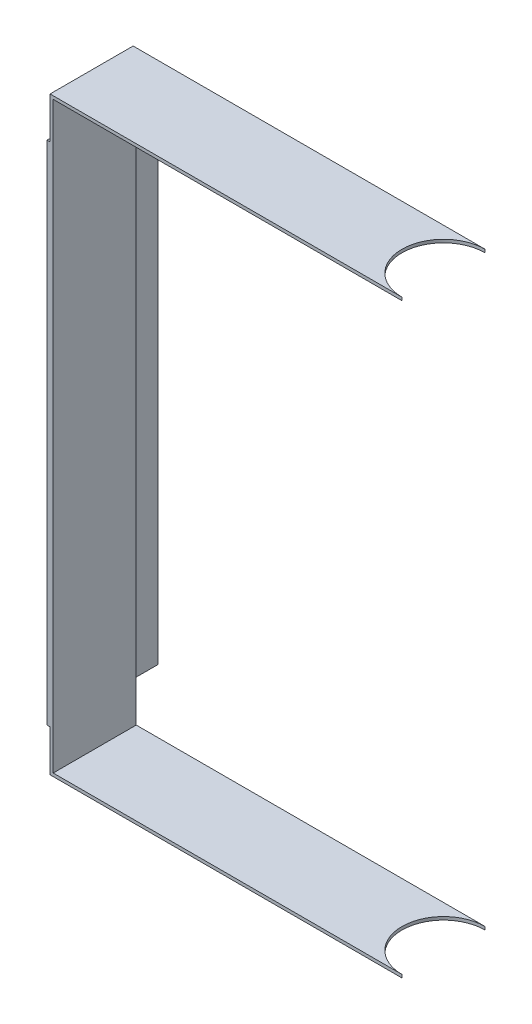
ISO-10303-21;
HEADER;
FILE_DESCRIPTION(('STEP AP214'),'2;1');
FILE_NAME('part.step','',(''),(''),'','','');
FILE_SCHEMA(('AUTOMOTIVE_DESIGN { 1 0 10303 214 1 1 1 1 }'));
ENDSEC;
DATA;
#1=APPLICATION_CONTEXT('core data for automotive mechanical design processes');
#2=APPLICATION_PROTOCOL_DEFINITION('international standard','automotive_design',2000,#1);
#3=PRODUCT_CONTEXT('',#1,'mechanical');
#4=PRODUCT('Part','Part','',(#3));
#5=PRODUCT_RELATED_PRODUCT_CATEGORY('part','',(#4));
#6=PRODUCT_DEFINITION_FORMATION('','',#4);
#7=PRODUCT_DEFINITION_CONTEXT('part definition',#1,'design');
#8=PRODUCT_DEFINITION('design','',#6,#7);
#9=PRODUCT_DEFINITION_SHAPE('','',#8);
#10=(LENGTH_UNIT() NAMED_UNIT(*) SI_UNIT(.MILLI.,.METRE.));
#11=(NAMED_UNIT(*) PLANE_ANGLE_UNIT() SI_UNIT($,.RADIAN.));
#12=(NAMED_UNIT(*) SI_UNIT($,.STERADIAN.) SOLID_ANGLE_UNIT());
#13=UNCERTAINTY_MEASURE_WITH_UNIT(LENGTH_MEASURE(1.E-05),#10,'distance_accuracy_value','');
#14=(GEOMETRIC_REPRESENTATION_CONTEXT(3) GLOBAL_UNCERTAINTY_ASSIGNED_CONTEXT((#13)) GLOBAL_UNIT_ASSIGNED_CONTEXT((#10,
#11,#12)) REPRESENTATION_CONTEXT('',''));
#15=CARTESIAN_POINT('',(0.,0.,0.));
#16=DIRECTION('',(0.,0.,1.));
#17=DIRECTION('',(1.,0.,0.));
#18=AXIS2_PLACEMENT_3D('',#15,#16,#17);
#19=CARTESIAN_POINT('',(-169.5,15.7412558306423,40.));
#20=DIRECTION('',(1.,0.,0.));
#21=DIRECTION('',(0.,0.,-1.));
#22=AXIS2_PLACEMENT_3D('',#19,#20,#21);
#23=PLANE('',#22);
#24=DIRECTION('',(0.,0.,1.));
#25=VECTOR('',#24,1.);
#26=CARTESIAN_POINT('',(-169.5,-248.258744169358,-12.));
#27=LINE('',#26,#25);
#28=CARTESIAN_POINT('',(-169.5,-248.258744169358,0.));
#29=VERTEX_POINT('',#28);
#30=CARTESIAN_POINT('',(-169.5,-248.258744169358,40.));
#31=VERTEX_POINT('',#30);
#32=EDGE_CURVE('E11',#29,#31,#27,.T.);
#33=ORIENTED_EDGE('',*,*,#32,.F.);
#34=DIRECTION('',(0.,-1.,0.));
#35=VECTOR('',#34,1.);
#36=CARTESIAN_POINT('',(-169.5,15.7412558306423,0.));
#37=LINE('',#36,#35);
#38=CARTESIAN_POINT('',(-169.5,-268.258744169358,0.));
#39=VERTEX_POINT('',#38);
#40=EDGE_CURVE('E198',#29,#39,#37,.T.);
#41=ORIENTED_EDGE('',*,*,#40,.T.);
#42=DIRECTION('',(0.,0.,-1.));
#43=VECTOR('',#42,1.);
#44=CARTESIAN_POINT('',(-169.5,-268.258744169358,40.));
#45=LINE('',#44,#43);
#46=CARTESIAN_POINT('',(-169.5,-268.258744169358,40.));
#47=VERTEX_POINT('',#46);
#48=EDGE_CURVE('E217',#47,#39,#45,.T.);
#49=ORIENTED_EDGE('',*,*,#48,.F.);
#50=DIRECTION('',(0.,-1.,0.));
#51=VECTOR('',#50,1.);
#52=CARTESIAN_POINT('',(-169.5,15.7412558306423,40.));
#53=LINE('',#52,#51);
#54=EDGE_CURVE('E55',#31,#47,#53,.T.);
#55=ORIENTED_EDGE('',*,*,#54,.F.);
#56=EDGE_LOOP('',(#33,#41,#49,#55));
#57=FACE_BOUND('',#56,.T.);
#58=ADVANCED_FACE('F38',(#57),#23,.F.);
#59=DIRECTION('',(0.,0.,-1.));
#60=VECTOR('',#59,1.);
#61=CARTESIAN_POINT('',(-169.5,-4.25874416935773,40.));
#62=LINE('',#61,#60);
#63=CARTESIAN_POINT('',(-169.5,-4.25874416935773,40.));
#64=VERTEX_POINT('',#63);
#65=CARTESIAN_POINT('',(-169.5,-4.25874416935773,0.));
#66=VERTEX_POINT('',#65);
#67=EDGE_CURVE('E62',#64,#66,#62,.T.);
#68=ORIENTED_EDGE('',*,*,#67,.F.);
#69=CARTESIAN_POINT('',(-169.5,15.7412558306423,40.));
#70=VERTEX_POINT('',#69);
#71=EDGE_CURVE('E157',#70,#64,#53,.T.);
#72=ORIENTED_EDGE('',*,*,#71,.F.);
#73=DIRECTION('',(0.,0.,-1.));
#74=VECTOR('',#73,1.);
#75=CARTESIAN_POINT('',(-169.5,15.7412558306423,40.));
#76=LINE('',#75,#74);
#77=CARTESIAN_POINT('',(-169.5,15.7412558306423,0.));
#78=VERTEX_POINT('',#77);
#79=EDGE_CURVE('E42',#70,#78,#76,.T.);
#80=ORIENTED_EDGE('',*,*,#79,.T.);
#81=EDGE_CURVE('E199',#78,#66,#37,.T.);
#82=ORIENTED_EDGE('',*,*,#81,.T.);
#83=EDGE_LOOP('',(#68,#72,#80,#82));
#84=FACE_BOUND('',#83,.T.);
#85=ADVANCED_FACE('F225',(#84),#23,.F.);
#86=CARTESIAN_POINT('',(0.,15.7412558306423,40.));
#87=DIRECTION('',(0.,-1.,0.));
#88=DIRECTION('',(0.,0.,-1.));
#89=AXIS2_PLACEMENT_3D('',#86,#87,#88);
#90=PLANE('',#89);
#91=DIRECTION('',(-1.,0.,0.));
#92=VECTOR('',#91,1.);
#93=CARTESIAN_POINT('',(0.,15.7412558306423,40.));
#94=LINE('',#93,#92);
#95=CARTESIAN_POINT('',(0.,15.7412558306423,40.));
#96=VERTEX_POINT('',#95);
#97=EDGE_CURVE('E177',#96,#70,#94,.T.);
#98=ORIENTED_EDGE('',*,*,#97,.F.);
#99=CARTESIAN_POINT('',(0.,15.7412558306423,20.));
#100=DIRECTION('',(0.,-1.,0.));
#101=DIRECTION('',(0.,0.,-1.));
#102=AXIS2_PLACEMENT_3D('',#99,#100,#101);
#103=CIRCLE('',#102,20.);
#104=CARTESIAN_POINT('',(0.,15.7412558306423,0.));
#105=VERTEX_POINT('',#104);
#106=EDGE_CURVE('E171',#96,#105,#103,.T.);
#107=ORIENTED_EDGE('',*,*,#106,.T.);
#108=DIRECTION('',(-1.,0.,0.));
#109=VECTOR('',#108,1.);
#110=CARTESIAN_POINT('',(0.,15.7412558306423,0.));
#111=LINE('',#110,#109);
#112=EDGE_CURVE('E196',#105,#78,#111,.T.);
#113=ORIENTED_EDGE('',*,*,#112,.T.);
#114=ORIENTED_EDGE('',*,*,#79,.F.);
#115=EDGE_LOOP('',(#98,#107,#113,#114));
#116=FACE_BOUND('',#115,.T.);
#117=ADVANCED_FACE('F40',(#116),#90,.F.);
#118=CARTESIAN_POINT('',(-169.5,-268.258744169358,40.));
#119=DIRECTION('',(0.,1.,0.));
#120=DIRECTION('',(0.,0.,1.));
#121=AXIS2_PLACEMENT_3D('',#118,#119,#120);
#122=PLANE('',#121);
#123=DIRECTION('',(1.,0.,0.));
#124=VECTOR('',#123,1.);
#125=CARTESIAN_POINT('',(-169.5,-268.258744169358,0.));
#126=LINE('',#125,#124);
#127=CARTESIAN_POINT('',(0.,-268.258744169358,0.));
#128=VERTEX_POINT('',#127);
#129=EDGE_CURVE('E201',#39,#128,#126,.T.);
#130=ORIENTED_EDGE('',*,*,#129,.T.);
#131=CARTESIAN_POINT('',(0.,-268.258744169358,20.));
#132=DIRECTION('',(0.,-1.,0.));
#133=DIRECTION('',(0.,0.,-1.));
#134=AXIS2_PLACEMENT_3D('',#131,#132,#133);
#135=CIRCLE('',#134,20.);
#136=CARTESIAN_POINT('',(0.,-268.258744169358,40.));
#137=VERTEX_POINT('',#136);
#138=EDGE_CURVE('E158',#137,#128,#135,.T.);
#139=ORIENTED_EDGE('',*,*,#138,.F.);
#140=DIRECTION('',(1.,0.,0.));
#141=VECTOR('',#140,1.);
#142=CARTESIAN_POINT('',(-169.5,-268.258744169358,40.));
#143=LINE('',#142,#141);
#144=EDGE_CURVE('E181',#47,#137,#143,.T.);
#145=ORIENTED_EDGE('',*,*,#144,.F.);
#146=ORIENTED_EDGE('',*,*,#48,.T.);
#147=EDGE_LOOP('',(#130,#139,#145,#146));
#148=FACE_BOUND('',#147,.T.);
#149=ADVANCED_FACE('F268',(#148),#122,.F.);
#150=CARTESIAN_POINT('',(0.,-266.758744169358,40.));
#151=DIRECTION('',(0.,-1.,0.));
#152=DIRECTION('',(0.,0.,-1.));
#153=AXIS2_PLACEMENT_3D('',#150,#151,#152);
#154=PLANE('',#153);
#155=DIRECTION('',(-1.,0.,0.));
#156=VECTOR('',#155,1.);
#157=CARTESIAN_POINT('',(0.,-266.758744169358,40.));
#158=LINE('',#157,#156);
#159=CARTESIAN_POINT('',(0.,-266.758744169358,40.));
#160=VERTEX_POINT('',#159);
#161=CARTESIAN_POINT('',(-168.,-266.758744169358,40.));
#162=VERTEX_POINT('',#161);
#163=EDGE_CURVE('E187',#160,#162,#158,.T.);
#164=ORIENTED_EDGE('',*,*,#163,.F.);
#165=CARTESIAN_POINT('',(0.,-266.758744169358,20.));
#166=DIRECTION('',(0.,-1.,0.));
#167=DIRECTION('',(0.,0.,-1.));
#168=AXIS2_PLACEMENT_3D('',#165,#166,#167);
#169=CIRCLE('',#168,20.);
#170=CARTESIAN_POINT('',(0.,-266.758744169358,0.));
#171=VERTEX_POINT('',#170);
#172=EDGE_CURVE('E160',#160,#171,#169,.T.);
#173=ORIENTED_EDGE('',*,*,#172,.T.);
#174=DIRECTION('',(-1.,0.,0.));
#175=VECTOR('',#174,1.);
#176=CARTESIAN_POINT('',(0.,-266.758744169358,0.));
#177=LINE('',#176,#175);
#178=CARTESIAN_POINT('',(-168.,-266.758744169358,0.));
#179=VERTEX_POINT('',#178);
#180=EDGE_CURVE('E207',#171,#179,#177,.T.);
#181=ORIENTED_EDGE('',*,*,#180,.T.);
#182=DIRECTION('',(0.,0.,-1.));
#183=VECTOR('',#182,1.);
#184=CARTESIAN_POINT('',(-168.,-266.758744169358,40.));
#185=LINE('',#184,#183);
#186=EDGE_CURVE('E215',#162,#179,#185,.T.);
#187=ORIENTED_EDGE('',*,*,#186,.F.);
#188=EDGE_LOOP('',(#164,#173,#181,#187));
#189=FACE_BOUND('',#188,.T.);
#190=ADVANCED_FACE('F271',(#189),#154,.F.);
#191=CARTESIAN_POINT('',(-168.,14.2412558306423,40.));
#192=DIRECTION('',(-1.,0.,0.));
#193=DIRECTION('',(0.,0.,1.));
#194=AXIS2_PLACEMENT_3D('',#191,#192,#193);
#195=PLANE('',#194);
#196=DIRECTION('',(0.,1.,0.));
#197=VECTOR('',#196,1.);
#198=CARTESIAN_POINT('',(-168.,14.2412558306423,0.));
#199=LINE('',#198,#197);
#200=CARTESIAN_POINT('',(-168.,14.2412558306423,0.));
#201=VERTEX_POINT('',#200);
#202=EDGE_CURVE('E209',#179,#201,#199,.T.);
#203=ORIENTED_EDGE('',*,*,#202,.T.);
#204=DIRECTION('',(0.,0.,-1.));
#205=VECTOR('',#204,1.);
#206=CARTESIAN_POINT('',(-168.,14.2412558306423,40.));
#207=LINE('',#206,#205);
#208=CARTESIAN_POINT('',(-168.,14.2412558306423,40.));
#209=VERTEX_POINT('',#208);
#210=EDGE_CURVE('E194',#209,#201,#207,.T.);
#211=ORIENTED_EDGE('',*,*,#210,.F.);
#212=DIRECTION('',(0.,1.,0.));
#213=VECTOR('',#212,1.);
#214=CARTESIAN_POINT('',(-168.,14.2412558306423,40.));
#215=LINE('',#214,#213);
#216=EDGE_CURVE('E189',#162,#209,#215,.T.);
#217=ORIENTED_EDGE('',*,*,#216,.F.);
#218=ORIENTED_EDGE('',*,*,#186,.T.);
#219=EDGE_LOOP('',(#203,#211,#217,#218));
#220=FACE_BOUND('',#219,.T.);
#221=ADVANCED_FACE('F274',(#220),#195,.F.);
#222=CARTESIAN_POINT('',(0.,14.2412558306423,40.));
#223=DIRECTION('',(0.,1.,0.));
#224=DIRECTION('',(0.,0.,1.));
#225=AXIS2_PLACEMENT_3D('',#222,#223,#224);
#226=PLANE('',#225);
#227=DIRECTION('',(1.,0.,0.));
#228=VECTOR('',#227,1.);
#229=CARTESIAN_POINT('',(0.,14.2412558306423,0.));
#230=LINE('',#229,#228);
#231=CARTESIAN_POINT('',(0.,14.2412558306423,0.));
#232=VERTEX_POINT('',#231);
#233=EDGE_CURVE('E178',#201,#232,#230,.T.);
#234=ORIENTED_EDGE('',*,*,#233,.T.);
#235=CARTESIAN_POINT('',(0.,14.2412558306423,20.));
#236=DIRECTION('',(0.,1.,0.));
#237=DIRECTION('',(0.,0.,1.));
#238=AXIS2_PLACEMENT_3D('',#235,#236,#237);
#239=CIRCLE('',#238,20.);
#240=CARTESIAN_POINT('',(0.,14.2412558306423,40.));
#241=VERTEX_POINT('',#240);
#242=EDGE_CURVE('E168',#232,#241,#239,.T.);
#243=ORIENTED_EDGE('',*,*,#242,.T.);
#244=DIRECTION('',(1.,0.,0.));
#245=VECTOR('',#244,1.);
#246=CARTESIAN_POINT('',(0.,14.2412558306423,40.));
#247=LINE('',#246,#245);
#248=EDGE_CURVE('E191',#209,#241,#247,.T.);
#249=ORIENTED_EDGE('',*,*,#248,.F.);
#250=ORIENTED_EDGE('',*,*,#210,.T.);
#251=EDGE_LOOP('',(#234,#243,#249,#250));
#252=FACE_BOUND('',#251,.T.);
#253=ADVANCED_FACE('F278',(#252),#226,.F.);
#254=CARTESIAN_POINT('',(0.,0.,40.));
#255=DIRECTION('',(0.,0.,-1.));
#256=DIRECTION('',(-1.,0.,0.));
#257=AXIS2_PLACEMENT_3D('',#254,#255,#256);
#258=PLANE('',#257);
#259=DIRECTION('',(0.,1.,0.));
#260=VECTOR('',#259,1.);
#261=CARTESIAN_POINT('',(0.,15.7412558306423,40.));
#262=LINE('',#261,#260);
#263=EDGE_CURVE('E175',#241,#96,#262,.T.);
#264=ORIENTED_EDGE('',*,*,#263,.T.);
#265=ORIENTED_EDGE('',*,*,#97,.T.);
#266=ORIENTED_EDGE('',*,*,#71,.T.);
#267=DIRECTION('',(1.,0.,0.));
#268=VECTOR('',#267,1.);
#269=CARTESIAN_POINT('',(-171.,-4.25874416935773,40.));
#270=LINE('',#269,#268);
#271=CARTESIAN_POINT('',(-171.,-4.25874416935773,40.));
#272=VERTEX_POINT('',#271);
#273=EDGE_CURVE('E139',#272,#64,#270,.T.);
#274=ORIENTED_EDGE('',*,*,#273,.F.);
#275=DIRECTION('',(0.,1.,0.));
#276=VECTOR('',#275,1.);
#277=CARTESIAN_POINT('',(-171.,-248.258744169358,40.));
#278=LINE('',#277,#276);
#279=CARTESIAN_POINT('',(-171.,-248.258744169358,40.));
#280=VERTEX_POINT('',#279);
#281=EDGE_CURVE('E145',#280,#272,#278,.T.);
#282=ORIENTED_EDGE('',*,*,#281,.F.);
#283=DIRECTION('',(1.,0.,0.));
#284=VECTOR('',#283,1.);
#285=CARTESIAN_POINT('',(-171.,-248.258744169358,40.));
#286=LINE('',#285,#284);
#287=EDGE_CURVE('E248',#280,#31,#286,.T.);
#288=ORIENTED_EDGE('',*,*,#287,.T.);
#289=ORIENTED_EDGE('',*,*,#54,.T.);
#290=ORIENTED_EDGE('',*,*,#144,.T.);
#291=DIRECTION('',(0.,1.,0.));
#292=VECTOR('',#291,1.);
#293=CARTESIAN_POINT('',(0.,-268.258744169358,40.));
#294=LINE('',#293,#292);
#295=EDGE_CURVE('E184',#137,#160,#294,.T.);
#296=ORIENTED_EDGE('',*,*,#295,.T.);
#297=ORIENTED_EDGE('',*,*,#163,.T.);
#298=ORIENTED_EDGE('',*,*,#216,.T.);
#299=ORIENTED_EDGE('',*,*,#248,.T.);
#300=EDGE_LOOP('',(#264,#265,#266,#274,#282,#288,#289,#290,#296,#297,#298,#299));
#301=FACE_BOUND('',#300,.T.);
#302=ADVANCED_FACE('F156',(#301),#258,.F.);
#303=CARTESIAN_POINT('',(0.,0.,0.));
#304=DIRECTION('',(0.,0.,-1.));
#305=DIRECTION('',(-1.,0.,0.));
#306=AXIS2_PLACEMENT_3D('',#303,#304,#305);
#307=PLANE('',#306);
#308=DIRECTION('',(0.,1.,0.));
#309=VECTOR('',#308,1.);
#310=CARTESIAN_POINT('',(0.,15.7412558306423,0.));
#311=LINE('',#310,#309);
#312=EDGE_CURVE('E174',#232,#105,#311,.T.);
#313=ORIENTED_EDGE('',*,*,#312,.F.);
#314=ORIENTED_EDGE('',*,*,#233,.F.);
#315=ORIENTED_EDGE('',*,*,#202,.F.);
#316=ORIENTED_EDGE('',*,*,#180,.F.);
#317=DIRECTION('',(0.,1.,0.));
#318=VECTOR('',#317,1.);
#319=CARTESIAN_POINT('',(0.,-268.258744169358,0.));
#320=LINE('',#319,#318);
#321=EDGE_CURVE('E205',#128,#171,#320,.T.);
#322=ORIENTED_EDGE('',*,*,#321,.F.);
#323=ORIENTED_EDGE('',*,*,#129,.F.);
#324=ORIENTED_EDGE('',*,*,#40,.F.);
#325=EDGE_CURVE('E202',#66,#29,#37,.T.);
#326=ORIENTED_EDGE('',*,*,#325,.F.);
#327=ORIENTED_EDGE('',*,*,#81,.F.);
#328=ORIENTED_EDGE('',*,*,#112,.F.);
#329=EDGE_LOOP('',(#313,#314,#315,#316,#322,#323,#324,#326,#327,#328));
#330=FACE_BOUND('',#329,.T.);
#331=ADVANCED_FACE('F232',(#330),#307,.T.);
#332=CARTESIAN_POINT('',(0.,67.7412558306423,20.));
#333=DIRECTION('',(0.,-1.,0.));
#334=DIRECTION('',(0.,0.,-1.));
#335=AXIS2_PLACEMENT_3D('',#332,#333,#334);
#336=CYLINDRICAL_SURFACE('',#335,20.);
#337=ORIENTED_EDGE('',*,*,#138,.T.);
#338=ORIENTED_EDGE('',*,*,#321,.T.);
#339=ORIENTED_EDGE('',*,*,#172,.F.);
#340=ORIENTED_EDGE('',*,*,#295,.F.);
#341=EDGE_LOOP('',(#337,#338,#339,#340));
#342=FACE_BOUND('',#341,.T.);
#343=ADVANCED_FACE('F285',(#342),#336,.F.);
#344=ORIENTED_EDGE('',*,*,#242,.F.);
#345=ORIENTED_EDGE('',*,*,#312,.T.);
#346=ORIENTED_EDGE('',*,*,#106,.F.);
#347=ORIENTED_EDGE('',*,*,#263,.F.);
#348=EDGE_LOOP('',(#344,#345,#346,#347));
#349=FACE_BOUND('',#348,.T.);
#350=ADVANCED_FACE('F288',(#349),#336,.F.);
#351=CARTESIAN_POINT('',(-169.5,0.,0.));
#352=DIRECTION('',(-1.,0.,0.));
#353=DIRECTION('',(0.,0.,1.));
#354=AXIS2_PLACEMENT_3D('',#351,#352,#353);
#355=PLANE('',#354);
#356=CARTESIAN_POINT('',(-169.5,-4.25874416935773,-12.));
#357=VERTEX_POINT('',#356);
#358=EDGE_CURVE('E240',#66,#357,#62,.T.);
#359=ORIENTED_EDGE('',*,*,#358,.F.);
#360=ORIENTED_EDGE('',*,*,#325,.T.);
#361=CARTESIAN_POINT('',(-169.5,-248.258744169358,-12.));
#362=VERTEX_POINT('',#361);
#363=EDGE_CURVE('E48',#362,#29,#27,.T.);
#364=ORIENTED_EDGE('',*,*,#363,.F.);
#365=DIRECTION('',(0.,-1.,0.));
#366=VECTOR('',#365,1.);
#367=CARTESIAN_POINT('',(-169.5,-4.25874416935773,-12.));
#368=LINE('',#367,#366);
#369=EDGE_CURVE('E242',#357,#362,#368,.T.);
#370=ORIENTED_EDGE('',*,*,#369,.F.);
#371=EDGE_LOOP('',(#359,#360,#364,#370));
#372=FACE_BOUND('',#371,.T.);
#373=ADVANCED_FACE('F241',(#372),#355,.F.);
#374=CARTESIAN_POINT('',(-171.,-4.25874416935773,40.));
#375=DIRECTION('',(0.,-1.,0.));
#376=DIRECTION('',(0.,0.,-1.));
#377=AXIS2_PLACEMENT_3D('',#374,#375,#376);
#378=PLANE('',#377);
#379=ORIENTED_EDGE('',*,*,#67,.T.);
#380=ORIENTED_EDGE('',*,*,#358,.T.);
#381=DIRECTION('',(1.,0.,0.));
#382=VECTOR('',#381,1.);
#383=CARTESIAN_POINT('',(-171.,-4.25874416935773,-12.));
#384=LINE('',#383,#382);
#385=CARTESIAN_POINT('',(-171.,-4.25874416935773,-12.));
#386=VERTEX_POINT('',#385);
#387=EDGE_CURVE('E141',#386,#357,#384,.T.);
#388=ORIENTED_EDGE('',*,*,#387,.F.);
#389=DIRECTION('',(0.,0.,-1.));
#390=VECTOR('',#389,1.);
#391=CARTESIAN_POINT('',(-171.,-4.25874416935773,40.));
#392=LINE('',#391,#390);
#393=EDGE_CURVE('E135',#272,#386,#392,.T.);
#394=ORIENTED_EDGE('',*,*,#393,.F.);
#395=ORIENTED_EDGE('',*,*,#273,.T.);
#396=EDGE_LOOP('',(#379,#380,#388,#394,#395));
#397=FACE_BOUND('',#396,.T.);
#398=ADVANCED_FACE('F137',(#397),#378,.F.);
#399=CARTESIAN_POINT('',(-171.,-4.25874416935773,-12.));
#400=DIRECTION('',(0.,0.,1.));
#401=DIRECTION('',(1.,0.,0.));
#402=AXIS2_PLACEMENT_3D('',#399,#400,#401);
#403=PLANE('',#402);
#404=ORIENTED_EDGE('',*,*,#369,.T.);
#405=DIRECTION('',(1.,0.,0.));
#406=VECTOR('',#405,1.);
#407=CARTESIAN_POINT('',(-171.,-248.258744169358,-12.));
#408=LINE('',#407,#406);
#409=CARTESIAN_POINT('',(-171.,-248.258744169358,-12.));
#410=VERTEX_POINT('',#409);
#411=EDGE_CURVE('E162',#410,#362,#408,.T.);
#412=ORIENTED_EDGE('',*,*,#411,.F.);
#413=DIRECTION('',(0.,-1.,0.));
#414=VECTOR('',#413,1.);
#415=CARTESIAN_POINT('',(-171.,-4.25874416935773,-12.));
#416=LINE('',#415,#414);
#417=EDGE_CURVE('E144',#386,#410,#416,.T.);
#418=ORIENTED_EDGE('',*,*,#417,.F.);
#419=ORIENTED_EDGE('',*,*,#387,.T.);
#420=EDGE_LOOP('',(#404,#412,#418,#419));
#421=FACE_BOUND('',#420,.T.);
#422=ADVANCED_FACE('F254',(#421),#403,.F.);
#423=CARTESIAN_POINT('',(-171.,-248.258744169358,-12.));
#424=DIRECTION('',(0.,1.,0.));
#425=DIRECTION('',(0.,0.,1.));
#426=AXIS2_PLACEMENT_3D('',#423,#424,#425);
#427=PLANE('',#426);
#428=ORIENTED_EDGE('',*,*,#363,.T.);
#429=ORIENTED_EDGE('',*,*,#32,.T.);
#430=ORIENTED_EDGE('',*,*,#287,.F.);
#431=DIRECTION('',(0.,0.,1.));
#432=VECTOR('',#431,1.);
#433=CARTESIAN_POINT('',(-171.,-248.258744169358,-12.));
#434=LINE('',#433,#432);
#435=EDGE_CURVE('E150',#410,#280,#434,.T.);
#436=ORIENTED_EDGE('',*,*,#435,.F.);
#437=ORIENTED_EDGE('',*,*,#411,.T.);
#438=EDGE_LOOP('',(#428,#429,#430,#436,#437));
#439=FACE_BOUND('',#438,.T.);
#440=ADVANCED_FACE('F252',(#439),#427,.F.);
#441=CARTESIAN_POINT('',(-171.,0.,0.));
#442=DIRECTION('',(-1.,0.,0.));
#443=DIRECTION('',(0.,0.,1.));
#444=AXIS2_PLACEMENT_3D('',#441,#442,#443);
#445=PLANE('',#444);
#446=ORIENTED_EDGE('',*,*,#281,.T.);
#447=ORIENTED_EDGE('',*,*,#393,.T.);
#448=ORIENTED_EDGE('',*,*,#417,.T.);
#449=ORIENTED_EDGE('',*,*,#435,.T.);
#450=EDGE_LOOP('',(#446,#447,#448,#449));
#451=FACE_BOUND('',#450,.T.);
#452=ADVANCED_FACE('F148',(#451),#445,.T.);
#453=CLOSED_SHELL('',(#58,#85,#117,#149,#190,#221,#253,#302,#331,#343,#350,#373,#398,#422,#440,#452));
#454=MANIFOLD_SOLID_BREP('B2',#453);
#455=ADVANCED_BREP_SHAPE_REPRESENTATION('',(#18,#454),#14);
#456=SHAPE_DEFINITION_REPRESENTATION(#9,#455);
ENDSEC;
END-ISO-10303-21;
